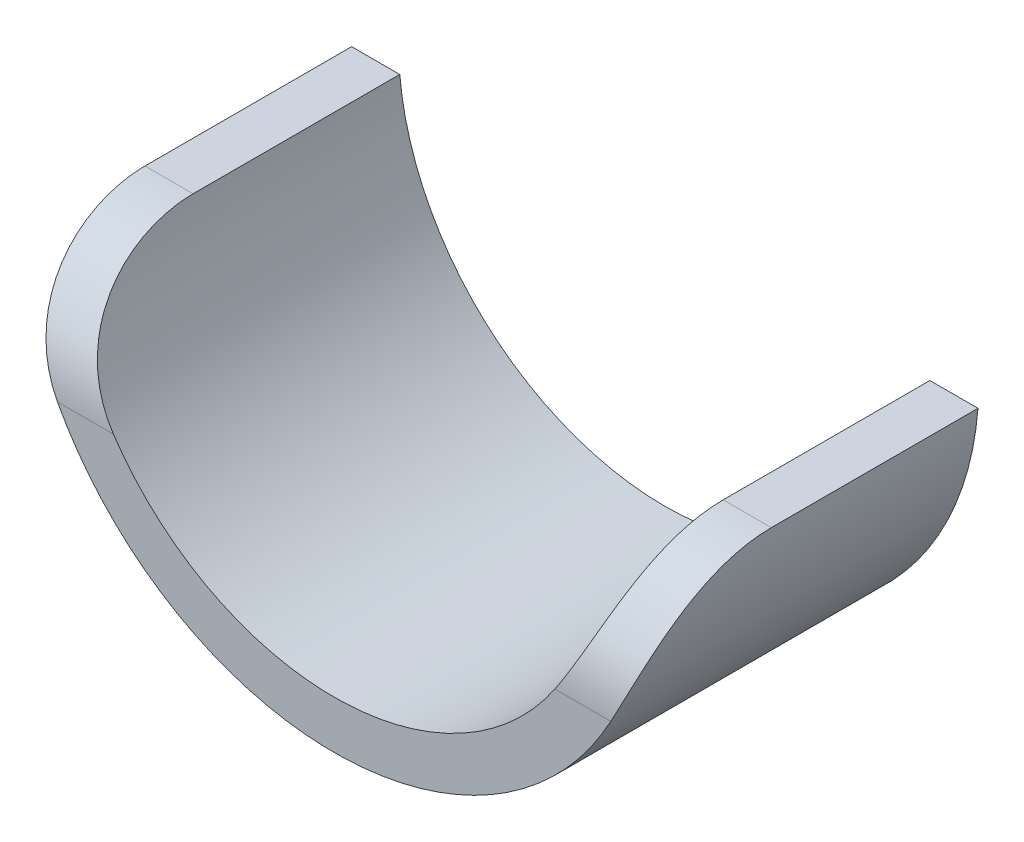
ISO-10303-21;
HEADER;
FILE_DESCRIPTION(('STEP AP214'),'2;1');
FILE_NAME('part.step','',(''),(''),'','','');
FILE_SCHEMA(('AUTOMOTIVE_DESIGN { 1 0 10303 214 1 1 1 1 }'));
ENDSEC;
DATA;
#1=APPLICATION_CONTEXT('core data for automotive mechanical design processes');
#2=APPLICATION_PROTOCOL_DEFINITION('international standard','automotive_design',2000,#1);
#3=PRODUCT_CONTEXT('',#1,'mechanical');
#4=PRODUCT('Part','Part','',(#3));
#5=PRODUCT_RELATED_PRODUCT_CATEGORY('part','',(#4));
#6=PRODUCT_DEFINITION_FORMATION('','',#4);
#7=PRODUCT_DEFINITION_CONTEXT('part definition',#1,'design');
#8=PRODUCT_DEFINITION('design','',#6,#7);
#9=PRODUCT_DEFINITION_SHAPE('','',#8);
#10=(LENGTH_UNIT() NAMED_UNIT(*) SI_UNIT(.MILLI.,.METRE.));
#11=(NAMED_UNIT(*) PLANE_ANGLE_UNIT() SI_UNIT($,.RADIAN.));
#12=(NAMED_UNIT(*) SI_UNIT($,.STERADIAN.) SOLID_ANGLE_UNIT());
#13=UNCERTAINTY_MEASURE_WITH_UNIT(LENGTH_MEASURE(1.E-05),#10,'distance_accuracy_value','');
#14=(GEOMETRIC_REPRESENTATION_CONTEXT(3) GLOBAL_UNCERTAINTY_ASSIGNED_CONTEXT((#13)) GLOBAL_UNIT_ASSIGNED_CONTEXT((#10,
#11,#12)) REPRESENTATION_CONTEXT('',''));
#15=CARTESIAN_POINT('',(0.,0.,0.));
#16=DIRECTION('',(0.,0.,1.));
#17=DIRECTION('',(1.,0.,0.));
#18=AXIS2_PLACEMENT_3D('',#15,#16,#17);
#19=CARTESIAN_POINT('',(0.,0.,0.));
#20=DIRECTION('',(0.,0.,1.));
#21=DIRECTION('',(1.,0.,0.));
#22=AXIS2_PLACEMENT_3D('',#19,#20,#21);
#23=CYLINDRICAL_SURFACE('',#22,20.447);
#24=CARTESIAN_POINT('',(20.3580643480661,-1.905,15.875));
#25=CARTESIAN_POINT('',(20.3580283743182,-1.90497110377044,16.1402102298547));
#26=CARTESIAN_POINT('',(20.3570267347558,-1.91607541741178,16.4054180979471));
#27=CARTESIAN_POINT('',(20.352832188804,-1.96034336128463,16.9339666940401));
#28=CARTESIAN_POINT('',(20.3496393032408,-1.99350678186011,17.1973074397624));
#29=CARTESIAN_POINT('',(20.3408028731761,-2.08168051639916,17.7202328918196));
#30=CARTESIAN_POINT('',(20.3351596248361,-2.13668819010333,17.9798180481544));
#31=CARTESIAN_POINT('',(20.3209194671558,-2.26813517562933,18.4934176434537));
#32=CARTESIAN_POINT('',(20.312322614697,-2.34457407471701,18.7474321895985));
#33=CARTESIAN_POINT('',(20.2915062917797,-2.51837915517059,19.2482709412747));
#34=CARTESIAN_POINT('',(20.2792839976529,-2.61576163208615,19.4950893769526));
#35=CARTESIAN_POINT('',(20.2504056126832,-2.83065885374987,19.9795302579563));
#36=CARTESIAN_POINT('',(20.2337496012912,-2.94817323772638,20.2171528679814));
#37=CARTESIAN_POINT('',(20.1950801117434,-3.20235227155138,20.6813968667695));
#38=CARTESIAN_POINT('',(20.1730679625452,-3.33901216747872,20.9080209677631));
#39=CARTESIAN_POINT('',(20.1226806227278,-3.63034088398203,21.3486359485486));
#40=CARTESIAN_POINT('',(20.0943055576867,-3.78500934911329,21.5626270775587));
#41=CARTESIAN_POINT('',(20.030560824482,-4.10893379759801,21.9737910836964));
#42=CARTESIAN_POINT('',(19.9952828225731,-4.27798374878302,22.1711404551238));
#43=CARTESIAN_POINT('',(19.9165452957226,-4.63073177356297,22.5505271872285));
#44=CARTESIAN_POINT('',(19.8730858362156,-4.81442972999755,22.7325646703523));
#45=CARTESIAN_POINT('',(19.7771267369428,-5.19456017598145,23.0799400708122));
#46=CARTESIAN_POINT('',(19.724633310632,-5.39098385541034,23.2452893429092));
#47=CARTESIAN_POINT('',(19.6098279166227,-5.7946943075757,23.5583716618498));
#48=CARTESIAN_POINT('',(19.5475162461149,-6.00198075137795,23.7061052416692));
#49=CARTESIAN_POINT('',(19.4144755131979,-6.41906899364777,23.9791033271186));
#50=CARTESIAN_POINT('',(19.3440467118341,-6.62861897179975,24.1048995061703));
#51=CARTESIAN_POINT('',(19.1930529525103,-7.05389488573657,24.3386995097784));
#52=CARTESIAN_POINT('',(19.112488048742,-7.26962078849771,24.4467034294521));
#53=CARTESIAN_POINT('',(18.9409635820805,-7.70549373801176,24.6448963006855));
#54=CARTESIAN_POINT('',(18.8499893436497,-7.92564665685007,24.7350595989152));
#55=CARTESIAN_POINT('',(18.6578079286869,-8.36804475355945,24.8975042974088));
#56=CARTESIAN_POINT('',(18.5566012015262,-8.59028983916224,24.9697864824619));
#57=CARTESIAN_POINT('',(18.3442481822495,-9.03487826701948,25.09684626075));
#58=CARTESIAN_POINT('',(18.2331065776499,-9.25722151419627,25.151632053993));
#59=CARTESIAN_POINT('',(18.0012194838146,-9.70043791104377,25.2443926711542));
#60=CARTESIAN_POINT('',(17.8804721898793,-9.92131077597433,25.2823643272213));
#61=CARTESIAN_POINT('',(17.6302342348166,-10.3594428106772,25.3422214514659));
#62=CARTESIAN_POINT('',(17.5007676745595,-10.5767100272521,25.3641494218749));
#63=CARTESIAN_POINT('',(17.2334730625404,-11.0068892110169,25.3930413515876));
#64=CARTESIAN_POINT('',(17.0956499678061,-11.219803661908,25.4000140946186));
#65=CARTESIAN_POINT('',(16.9539054202856,-11.4300000000005,25.4));
#66=B_SPLINE_CURVE_WITH_KNOTS('',3,(#24,#25,#26,#27,#28,#29,#30,#31,#32,#33,#34,#35,#36,#37,#38,
#39,#40,#41,#42,#43,#44,#45,#46,#47,#48,#49,#50,#51,#52,#53,#54,#55,#56,#57,#58,#59,#60,#61,#62,
#63,#64,#65),.UNSPECIFIED.,.F.,.F.,(4,2,2,2,2,2,2,2,2,2,2,2,2,2,2,2,2,2,2,2,4),(0.,
0.795393423654689,1.59077928777244,2.38606904486716,3.18134348689319,3.97723896055609,
4.77312017295292,5.5688041133931,6.3644723516572,7.15021538340831,7.93595213111671,
8.72115060258975,9.50632531127379,10.2684854549721,11.0306415240326,11.7938856708571,
12.5570963134924,13.3199487366032,14.0829448230853,14.8439122217058,15.6044325550745),.UNSPECIFIED.);
#67=CARTESIAN_POINT('',(20.3580643480667,-1.905,15.875));
#68=VERTEX_POINT('',#67);
#69=CARTESIAN_POINT('',(16.9539054202858,-11.4300000000002,25.4));
#70=VERTEX_POINT('',#69);
#71=EDGE_CURVE('E119',#68,#70,#66,.T.);
#72=ORIENTED_EDGE('',*,*,#71,.F.);
#73=DIRECTION('',(0.,0.,-1.));
#74=VECTOR('',#73,1.);
#75=CARTESIAN_POINT('',(20.3580643480672,-1.905,25.4));
#76=LINE('',#75,#74);
#77=CARTESIAN_POINT('',(20.3580643480667,-1.905,0.));
#78=VERTEX_POINT('',#77);
#79=EDGE_CURVE('E66',#68,#78,#76,.T.);
#80=ORIENTED_EDGE('',*,*,#79,.T.);
#81=CARTESIAN_POINT('',(0.,0.,0.));
#82=DIRECTION('',(0.,0.,1.));
#83=DIRECTION('',(1.,0.,0.));
#84=AXIS2_PLACEMENT_3D('',#81,#82,#83);
#85=CIRCLE('',#84,20.447);
#86=CARTESIAN_POINT('',(-20.3580643480667,-1.905,0.));
#87=VERTEX_POINT('',#86);
#88=EDGE_CURVE('E20',#78,#87,#85,.F.);
#89=ORIENTED_EDGE('',*,*,#88,.T.);
#90=DIRECTION('',(0.,0.,-1.));
#91=VECTOR('',#90,1.);
#92=CARTESIAN_POINT('',(-20.3580643480672,-1.905,25.4));
#93=LINE('',#92,#91);
#94=CARTESIAN_POINT('',(-20.3580643480667,-1.905,15.875));
#95=VERTEX_POINT('',#94);
#96=EDGE_CURVE('E71',#87,#95,#93,.F.);
#97=ORIENTED_EDGE('',*,*,#96,.T.);
#98=CARTESIAN_POINT('',(-16.9539054202856,-11.4300000000005,25.4));
#99=CARTESIAN_POINT('',(-17.1110348965794,-11.1970109347337,25.4000226556267));
#100=CARTESIAN_POINT('',(-17.2633409521732,-10.9606584924527,25.3914500347272));
#101=CARTESIAN_POINT('',(-17.5576316342127,-10.482734509668,25.355805674674));
#102=CARTESIAN_POINT('',(-17.6996080681934,-10.2411590195225,25.3287194254924));
#103=CARTESIAN_POINT('',(-17.9727321356882,-9.7539249200564,25.2546221946283));
#104=CARTESIAN_POINT('',(-18.1038453856934,-9.50825609668638,25.2075506354637));
#105=CARTESIAN_POINT('',(-18.3540664977229,-9.01577956315713,25.0924335496911));
#106=CARTESIAN_POINT('',(-18.4731775128224,-8.76897217002004,25.0243935508085));
#107=CARTESIAN_POINT('',(-18.6995490297243,-8.27531248509799,24.8661675409617));
#108=CARTESIAN_POINT('',(-18.8067447749872,-8.02846661678055,24.775868352864));
#109=CARTESIAN_POINT('',(-19.0083559040057,-7.53872313086937,24.572921907335));
#110=CARTESIAN_POINT('',(-19.1027701242965,-7.29582587447465,24.4602726177374));
#111=CARTESIAN_POINT('',(-19.2786895398163,-6.81738744881162,24.2129724372477));
#112=CARTESIAN_POINT('',(-19.360222754746,-6.58183123312732,24.0783706334243));
#113=CARTESIAN_POINT('',(-19.5110161349572,-6.12037421258561,23.7875131399525));
#114=CARTESIAN_POINT('',(-19.5802775147309,-5.89447245394794,23.6312595958167));
#115=CARTESIAN_POINT('',(-19.7015990829016,-5.47451213954666,23.3128068999594));
#116=CARTESIAN_POINT('',(-19.7546393047696,-5.27940511020501,23.1523591154929));
#117=CARTESIAN_POINT('',(-19.8518094278577,-4.90138340496403,22.8152389982501));
#118=CARTESIAN_POINT('',(-19.8959398183608,-4.71846805992874,22.6385675571706));
#119=CARTESIAN_POINT('',(-19.9761515798859,-4.36644050139858,22.2700553152654));
#120=CARTESIAN_POINT('',(-20.0122275652698,-4.19733757130713,22.0782044800326));
#121=CARTESIAN_POINT('',(-20.0772114901172,-3.87459604014159,21.6807751805306));
#122=CARTESIAN_POINT('',(-20.1061193740591,-3.72095755885489,21.4751966099471));
#123=CARTESIAN_POINT('',(-20.1574291495039,-3.43207667548712,21.0541231471337));
#124=CARTESIAN_POINT('',(-20.1798996243165,-3.2966491893578,20.8387634789851));
#125=CARTESIAN_POINT('',(-20.2196697315628,-3.0432271402361,20.39743775902));
#126=CARTESIAN_POINT('',(-20.2369670251252,-2.92524047465024,20.171466963014));
#127=CARTESIAN_POINT('',(-20.2672218373143,-2.70769131917894,19.7106066360459));
#128=CARTESIAN_POINT('',(-20.2801802255078,-2.60812513940783,19.4757189026592));
#129=CARTESIAN_POINT('',(-20.3025150068543,-2.42815162760397,18.9986688117078));
#130=CARTESIAN_POINT('',(-20.3118930616464,-2.34773541457413,18.756509885141));
#131=CARTESIAN_POINT('',(-20.3267077281063,-2.21553591633542,18.2975700959992));
#132=CARTESIAN_POINT('',(-20.3324935680789,-2.16141368417326,18.0814702333096));
#133=CARTESIAN_POINT('',(-20.3421616557291,-2.06843955546326,17.6459826812805));
#134=CARTESIAN_POINT('',(-20.3460440736285,-2.02958629348421,17.4265952877516));
#135=CARTESIAN_POINT('',(-20.352157279265,-1.96736786921803,16.9857348518923));
#136=CARTESIAN_POINT('',(-20.3543889527872,-1.94399440122066,16.7642629927905));
#137=CARTESIAN_POINT('',(-20.3573335916408,-1.91280264393239,16.3201947515685));
#138=CARTESIAN_POINT('',(-20.358046407436,-1.9049858862538,16.097598260887));
#139=CARTESIAN_POINT('',(-20.3580643480661,-1.905,15.875));
#140=B_SPLINE_CURVE_WITH_KNOTS('',3,(#98,#99,#100,#101,#102,#103,#104,#105,#106,#107,#108,#109,
#110,#111,#112,#113,#114,#115,#116,#117,#118,#119,#120,#121,#122,#123,#124,#125,#126,#127,#128,
#129,#130,#131,#132,#133,#134,#135,#136,#137,#138,#139),.UNSPECIFIED.,.F.,.F.,(4,2,2,2,2,2,2,2,
2,2,2,2,2,2,2,2,2,2,2,2,4),(0.,0.843012231859937,1.68668593203059,2.53293535688573,
3.37896188300101,4.22938213047327,5.07987973723872,5.92850102018473,6.77703827167084,
7.55044553476643,8.32381031468319,9.09769067222064,9.87157702376176,10.6368826673751,
11.4025337956785,12.1680313867014,12.9331732758273,13.6011795842376,14.2691261424277,
14.9367140217585,15.6043676241909),.UNSPECIFIED.);
#141=CARTESIAN_POINT('',(-16.9539054202858,-11.4300000000002,25.4));
#142=VERTEX_POINT('',#141);
#143=EDGE_CURVE('E111',#142,#95,#140,.T.);
#144=ORIENTED_EDGE('',*,*,#143,.F.);
#145=CARTESIAN_POINT('',(0.,0.,25.4));
#146=DIRECTION('',(0.,0.,1.));
#147=DIRECTION('',(1.,0.,0.));
#148=AXIS2_PLACEMENT_3D('',#145,#146,#147);
#149=CIRCLE('',#148,20.447);
#150=EDGE_CURVE('E117',#70,#142,#149,.F.);
#151=ORIENTED_EDGE('',*,*,#150,.F.);
#152=EDGE_LOOP('',(#72,#80,#89,#97,#144,#151));
#153=FACE_BOUND('',#152,.T.);
#154=ADVANCED_FACE('F16',(#153),#23,.F.);
#155=CARTESIAN_POINT('',(-24.13,-1.905,25.4));
#156=DIRECTION('',(0.,-1.,0.));
#157=DIRECTION('',(0.,0.,-1.));
#158=AXIS2_PLACEMENT_3D('',#155,#156,#157);
#159=PLANE('',#158);
#160=DIRECTION('',(1.,0.,0.));
#161=VECTOR('',#160,1.);
#162=CARTESIAN_POINT('',(0.,-1.905,0.));
#163=LINE('',#162,#161);
#164=CARTESIAN_POINT('',(-24.0546850945923,-1.90499999999999,0.));
#165=VERTEX_POINT('',#164);
#166=EDGE_CURVE('E75',#87,#165,#163,.F.);
#167=ORIENTED_EDGE('',*,*,#166,.T.);
#168=DIRECTION('',(0.,0.,1.));
#169=VECTOR('',#168,1.);
#170=CARTESIAN_POINT('',(-24.0546850945923,-1.90499999999997,0.));
#171=LINE('',#170,#169);
#172=CARTESIAN_POINT('',(-24.0546850945923,-1.90499999999999,15.875));
#173=VERTEX_POINT('',#172);
#174=EDGE_CURVE('E144',#173,#165,#171,.F.);
#175=ORIENTED_EDGE('',*,*,#174,.F.);
#176=DIRECTION('',(-1.,0.,0.));
#177=VECTOR('',#176,1.);
#178=CARTESIAN_POINT('',(86.7700600732234,-1.905,15.875));
#179=LINE('',#178,#177);
#180=EDGE_CURVE('E78',#95,#173,#179,.T.);
#181=ORIENTED_EDGE('',*,*,#180,.F.);
#182=ORIENTED_EDGE('',*,*,#96,.F.);
#183=EDGE_LOOP('',(#167,#175,#181,#182));
#184=FACE_BOUND('',#183,.T.);
#185=ADVANCED_FACE('F72',(#184),#159,.F.);
#186=CARTESIAN_POINT('',(0.,0.,0.));
#187=DIRECTION('',(0.,0.,1.));
#188=DIRECTION('',(1.,0.,0.));
#189=AXIS2_PLACEMENT_3D('',#186,#187,#188);
#190=PLANE('',#189);
#191=DIRECTION('',(1.,0.,0.));
#192=VECTOR('',#191,1.);
#193=CARTESIAN_POINT('',(-24.13,-1.905,0.));
#194=LINE('',#193,#192);
#195=CARTESIAN_POINT('',(24.0546850945923,-1.905,0.));
#196=VERTEX_POINT('',#195);
#197=EDGE_CURVE('E90',#78,#196,#194,.T.);
#198=ORIENTED_EDGE('',*,*,#197,.T.);
#199=CARTESIAN_POINT('',(0.,0.,0.));
#200=DIRECTION('',(0.,0.,1.));
#201=DIRECTION('',(1.,0.,0.));
#202=AXIS2_PLACEMENT_3D('',#199,#200,#201);
#203=CIRCLE('',#202,24.13);
#204=EDGE_CURVE('E86',#165,#196,#203,.T.);
#205=ORIENTED_EDGE('',*,*,#204,.F.);
#206=ORIENTED_EDGE('',*,*,#166,.F.);
#207=ORIENTED_EDGE('',*,*,#88,.F.);
#208=EDGE_LOOP('',(#198,#205,#206,#207));
#209=FACE_BOUND('',#208,.T.);
#210=ADVANCED_FACE('F84',(#209),#190,.F.);
#211=CARTESIAN_POINT('',(-24.13,-1.905,25.4));
#212=DIRECTION('',(0.,-1.,0.));
#213=DIRECTION('',(0.,0.,-1.));
#214=AXIS2_PLACEMENT_3D('',#211,#212,#213);
#215=PLANE('',#214);
#216=ORIENTED_EDGE('',*,*,#197,.F.);
#217=ORIENTED_EDGE('',*,*,#79,.F.);
#218=DIRECTION('',(-1.,0.,0.));
#219=VECTOR('',#218,1.);
#220=CARTESIAN_POINT('',(86.7700600732234,-1.905,15.875));
#221=LINE('',#220,#219);
#222=CARTESIAN_POINT('',(24.0546850945923,-1.905,15.875));
#223=VERTEX_POINT('',#222);
#224=EDGE_CURVE('E123',#223,#68,#221,.T.);
#225=ORIENTED_EDGE('',*,*,#224,.F.);
#226=DIRECTION('',(0.,0.,1.));
#227=VECTOR('',#226,1.);
#228=CARTESIAN_POINT('',(24.0546850945923,-1.90499999999999,0.));
#229=LINE('',#228,#227);
#230=EDGE_CURVE('E137',#196,#223,#229,.T.);
#231=ORIENTED_EDGE('',*,*,#230,.F.);
#232=EDGE_LOOP('',(#216,#217,#225,#231));
#233=FACE_BOUND('',#232,.T.);
#234=ADVANCED_FACE('F128',(#233),#215,.F.);
#235=CARTESIAN_POINT('',(86.7700600732234,-11.43,15.875));
#236=DIRECTION('',(-1.,0.,0.));
#237=DIRECTION('',(0.,0.,1.));
#238=AXIS2_PLACEMENT_3D('',#235,#236,#237);
#239=CYLINDRICAL_SURFACE('',#238,9.525);
#240=ORIENTED_EDGE('',*,*,#224,.T.);
#241=ORIENTED_EDGE('',*,*,#71,.T.);
#242=DIRECTION('',(1.,0.,0.));
#243=VECTOR('',#242,1.);
#244=CARTESIAN_POINT('',(0.,-11.43,25.4));
#245=LINE('',#244,#243);
#246=CARTESIAN_POINT('',(21.2511646739655,-11.43,25.4));
#247=VERTEX_POINT('',#246);
#248=EDGE_CURVE('E118',#247,#70,#245,.F.);
#249=ORIENTED_EDGE('',*,*,#248,.F.);
#250=CARTESIAN_POINT('',(24.0546850945923,-1.905,15.875));
#251=CARTESIAN_POINT('',(24.0546543706783,-1.90497112249099,16.1409714413934));
#252=CARTESIAN_POINT('',(24.0538018907344,-1.91613908815105,16.4069400320739));
#253=CARTESIAN_POINT('',(24.0502314004206,-1.96066129940309,16.9369961272644));
#254=CARTESIAN_POINT('',(24.0475134277582,-1.99401509654734,17.2010836696873));
#255=CARTESIAN_POINT('',(24.0399910936523,-2.08268810274374,17.7254334921366));
#256=CARTESIAN_POINT('',(24.0351873665735,-2.1380006327919,17.9856969103763));
#257=CARTESIAN_POINT('',(24.0230644040504,-2.2701777631287,18.5006286159835));
#258=CARTESIAN_POINT('',(24.0157452121526,-2.34704199031998,18.7552970001285));
#259=CARTESIAN_POINT('',(23.9980216823762,-2.52181707329971,19.2573979344783));
#260=CARTESIAN_POINT('',(23.9876151932781,-2.61974259140439,19.5048253066537));
#261=CARTESIAN_POINT('',(23.9630257307452,-2.83586324053375,19.9904676925044));
#262=CARTESIAN_POINT('',(23.9488428057835,-2.9540581113811,20.22868282438));
#263=CARTESIAN_POINT('',(23.9159133288637,-3.20976539159896,20.6941133896688));
#264=CARTESIAN_POINT('',(23.8971677906916,-3.34727350681212,20.9213312531841));
#265=CARTESIAN_POINT('',(23.8542560267361,-3.64051036300694,21.3631480940328));
#266=CARTESIAN_POINT('',(23.8300898850306,-3.79623882135804,21.5777472670274));
#267=CARTESIAN_POINT('',(23.7757019327644,-4.12311644738061,21.9908668963949));
#268=CARTESIAN_POINT('',(23.7455368268045,-4.29411352349554,22.1895151415346));
#269=CARTESIAN_POINT('',(23.6781748356056,-4.65123007876343,22.5714355282988));
#270=CARTESIAN_POINT('',(23.6409779826139,-4.83734948856389,22.7547077404316));
#271=CARTESIAN_POINT('',(23.5587888909164,-5.22294907941938,23.1045141824383));
#272=CARTESIAN_POINT('',(23.5138002140805,-5.42242313023071,23.2710560055365));
#273=CARTESIAN_POINT('',(23.4153383321293,-5.83295582002549,23.5864014341545));
#274=CARTESIAN_POINT('',(23.3618653413296,-6.04401416629933,23.7352054875674));
#275=CARTESIAN_POINT('',(23.2471317644862,-6.47113711214399,24.011251447842));
#276=CARTESIAN_POINT('',(23.1860605993367,-6.68700031712436,24.1388840349217));
#277=CARTESIAN_POINT('',(23.0549352631465,-7.12596104699,24.375769016095));
#278=CARTESIAN_POINT('',(22.9848810136632,-7.34905863503499,24.4850212496675));
#279=CARTESIAN_POINT('',(22.8355565811858,-7.80069709441672,24.6849280427475));
#280=CARTESIAN_POINT('',(22.7562780033086,-8.02924277118396,24.7755654505681));
#281=CARTESIAN_POINT('',(22.5885730040502,-8.48959759740636,24.9380698866867));
#282=CARTESIAN_POINT('',(22.5001473529379,-8.72140647065202,25.0099384936993));
#283=CARTESIAN_POINT('',(22.3243212812767,-9.16141574281792,25.1283965862276));
#284=CARTESIAN_POINT('',(22.2378315842086,-9.36947657204712,25.176872535527));
#285=CARTESIAN_POINT('',(22.0579381550128,-9.7854805725288,25.2593565501162));
#286=CARTESIAN_POINT('',(21.9645342350342,-9.9934237404298,25.2933642221513));
#287=CARTESIAN_POINT('',(21.7713545092491,-10.4075477143403,25.347259877931));
#288=CARTESIAN_POINT('',(21.6715943779709,-10.6137315346704,25.3671812336891));
#289=CARTESIAN_POINT('',(21.4659113001519,-11.023810001918,25.393555082785));
#290=CARTESIAN_POINT('',(21.3599900405858,-11.2277052573947,25.4000112453408));
#291=CARTESIAN_POINT('',(21.2511646739657,-11.4299999999997,25.4));
#292=B_SPLINE_CURVE_WITH_KNOTS('',3,(#250,#251,#252,#253,#254,#255,#256,#257,#258,#259,#260,
#261,#262,#263,#264,#265,#266,#267,#268,#269,#270,#271,#272,#273,#274,#275,#276,#277,#278,#279,
#280,#281,#282,#283,#284,#285,#286,#287,#288,#289,#290,#291),.UNSPECIFIED.,.F.,.F.,(4,2,2,2,2,2,
2,2,2,2,2,2,2,2,2,2,2,2,2,2,4),(0.,0.79767480720018,1.59533349129077,2.39274974387176,
3.19015219264293,3.98811157936094,4.78606072424157,5.58383273105667,6.38159236462162,
7.17214191497642,7.96268783999794,8.75287333268876,9.54303886831845,10.316430031771,
11.0898279491281,11.8639353089751,12.6379775347455,13.3288503903547,14.0197420230187,
14.7089913240002,15.3980527824101),.UNSPECIFIED.);
#293=EDGE_CURVE('E132',#223,#247,#292,.T.);
#294=ORIENTED_EDGE('',*,*,#293,.F.);
#295=EDGE_LOOP('',(#240,#241,#249,#294));
#296=FACE_BOUND('',#295,.T.);
#297=ADVANCED_FACE('F124',(#296),#239,.T.);
#298=CARTESIAN_POINT('',(0.,0.,25.4));
#299=DIRECTION('',(0.,0.,1.));
#300=DIRECTION('',(1.,0.,0.));
#301=AXIS2_PLACEMENT_3D('',#298,#299,#300);
#302=PLANE('',#301);
#303=ORIENTED_EDGE('',*,*,#150,.T.);
#304=DIRECTION('',(-1.,0.,0.));
#305=VECTOR('',#304,1.);
#306=CARTESIAN_POINT('',(86.7700600732234,-11.43,25.4));
#307=LINE('',#306,#305);
#308=CARTESIAN_POINT('',(-21.2511646739656,-11.4299999999999,25.4));
#309=VERTEX_POINT('',#308);
#310=EDGE_CURVE('E35',#309,#142,#307,.F.);
#311=ORIENTED_EDGE('',*,*,#310,.F.);
#312=CARTESIAN_POINT('',(0.,0.,25.4));
#313=DIRECTION('',(0.,0.,1.));
#314=DIRECTION('',(1.,0.,0.));
#315=AXIS2_PLACEMENT_3D('',#312,#313,#314);
#316=CIRCLE('',#315,24.13);
#317=EDGE_CURVE('E26',#247,#309,#316,.F.);
#318=ORIENTED_EDGE('',*,*,#317,.F.);
#319=ORIENTED_EDGE('',*,*,#248,.T.);
#320=EDGE_LOOP('',(#303,#311,#318,#319));
#321=FACE_BOUND('',#320,.T.);
#322=ADVANCED_FACE('F106',(#321),#302,.T.);
#323=CARTESIAN_POINT('',(86.7700600732234,-11.43,15.875));
#324=DIRECTION('',(-1.,0.,0.));
#325=DIRECTION('',(0.,0.,1.));
#326=AXIS2_PLACEMENT_3D('',#323,#324,#325);
#327=CYLINDRICAL_SURFACE('',#326,9.525);
#328=ORIENTED_EDGE('',*,*,#180,.T.);
#329=CARTESIAN_POINT('',(-21.2511646739657,-11.4299999999997,25.4));
#330=CARTESIAN_POINT('',(-21.382433539311,-11.186022464054,25.4000262243007));
#331=CARTESIAN_POINT('',(-21.5094658719946,-10.9396845502,25.390625226913));
#332=CARTESIAN_POINT('',(-21.7544876609396,-10.4439055163115,25.3520763604122));
#333=CARTESIAN_POINT('',(-21.8724717766097,-10.1944626630501,25.3229169274913));
#334=CARTESIAN_POINT('',(-22.0988883031837,-9.6939031188028,25.2438811628811));
#335=CARTESIAN_POINT('',(-22.2073020174488,-9.44278413916148,25.1939653220145));
#336=CARTESIAN_POINT('',(-22.4138311063667,-8.94150477192927,25.0727976311978));
#337=CARTESIAN_POINT('',(-22.5119485785535,-8.69134419913728,25.0015501383378));
#338=CARTESIAN_POINT('',(-22.697987397351,-8.19324315777392,24.837035897122));
#339=CARTESIAN_POINT('',(-22.7858670176028,-7.94531533145681,24.74368343928));
#340=CARTESIAN_POINT('',(-22.950920286426,-7.45513554205424,24.5350822568299));
#341=CARTESIAN_POINT('',(-23.0280931434997,-7.21288399968715,24.4198319149111));
#342=CARTESIAN_POINT('',(-23.1717872843802,-6.73697795539704,24.1679808945322));
#343=CARTESIAN_POINT('',(-23.238325368346,-6.50331035205257,24.0314145781476));
#344=CARTESIAN_POINT('',(-23.3613112980713,-6.04664831564493,23.7374976111355));
#345=CARTESIAN_POINT('',(-23.417759861925,-5.82365312382973,23.5801484410583));
#346=CARTESIAN_POINT('',(-23.5178520749754,-5.40470991060279,23.2565289044685));
#347=CARTESIAN_POINT('',(-23.5620882559331,-5.20794553211151,23.09149629587));
#348=CARTESIAN_POINT('',(-23.6429526368408,-4.82757709066192,22.7452094936832));
#349=CARTESIAN_POINT('',(-23.6795811205675,-4.64397253699301,22.5639559055187));
#350=CARTESIAN_POINT('',(-23.7460034791518,-4.29143598197436,22.1863614795688));
#351=CARTESIAN_POINT('',(-23.7757936768714,-4.12251190492299,21.9900126000184));
#352=CARTESIAN_POINT('',(-23.8293278664702,-3.8008713904997,21.5836916173809));
#353=CARTESIAN_POINT('',(-23.8530718455232,-3.64815498751063,21.373719485395));
#354=CARTESIAN_POINT('',(-23.895213047223,-3.36104542848584,20.9429571443455));
#355=CARTESIAN_POINT('',(-23.9136419215247,-3.22654644377802,20.7222405269028));
#356=CARTESIAN_POINT('',(-23.9461355713094,-2.97581587645172,20.2703568855941));
#357=CARTESIAN_POINT('',(-23.9602003046431,-2.85958447026906,20.0391897608205));
#358=CARTESIAN_POINT('',(-23.9846954693647,-2.64628232956122,19.5680719041688));
#359=CARTESIAN_POINT('',(-23.9951268417838,-2.54920663658389,19.3281234644464));
#360=CARTESIAN_POINT('',(-24.0130070257699,-2.37488541721309,18.8410436270895));
#361=CARTESIAN_POINT('',(-24.0204562216298,-2.29763733622996,18.5939131593595));
#362=CARTESIAN_POINT('',(-24.0316919659944,-2.17660389124132,18.1429614045295));
#363=CARTESIAN_POINT('',(-24.0359096588211,-2.12922984902609,17.9401048839392));
#364=CARTESIAN_POINT('',(-24.0429774229925,-2.04787644322709,17.5317203009418));
#365=CARTESIAN_POINT('',(-24.0458276798666,-2.01389526265418,17.32619260484));
#366=CARTESIAN_POINT('',(-24.0503232209338,-1.95949981658251,16.913517140901));
#367=CARTESIAN_POINT('',(-24.0519695285443,-1.93907402968681,16.70637090067));
#368=CARTESIAN_POINT('',(-24.0541447550348,-1.9118178800914,16.2911504940653));
#369=CARTESIAN_POINT('',(-24.0546735144979,-1.90498945704754,16.0830761995474));
#370=CARTESIAN_POINT('',(-24.0546850945923,-1.905,15.875));
#371=B_SPLINE_CURVE_WITH_KNOTS('',3,(#329,#330,#331,#332,#333,#334,#335,#336,#337,#338,#339,
#340,#341,#342,#343,#344,#345,#346,#347,#348,#349,#350,#351,#352,#353,#354,#355,#356,#357,#358,
#359,#360,#361,#362,#363,#364,#365,#366,#367,#368,#369,#370),.UNSPECIFIED.,.F.,.F.,(4,2,2,2,2,2,
2,2,2,2,2,2,2,2,2,2,2,2,2,2,4),(0.,0.831053790770298,1.66259438406462,2.49572508742814,
3.32868573588823,4.16493056434454,5.00123717930455,5.83620930417517,6.67112197849122,
7.45196225401332,8.23277339798141,9.0140034275285,9.79523511433863,10.5717136526311,
11.3481996900132,12.1244844697336,12.9006691826561,13.5253091224102,14.1498642890196,
14.7738879332269,15.3980005876604),.UNSPECIFIED.);
#372=EDGE_CURVE('E11',#309,#173,#371,.T.);
#373=ORIENTED_EDGE('',*,*,#372,.F.);
#374=ORIENTED_EDGE('',*,*,#310,.T.);
#375=ORIENTED_EDGE('',*,*,#143,.T.);
#376=EDGE_LOOP('',(#328,#373,#374,#375));
#377=FACE_BOUND('',#376,.T.);
#378=ADVANCED_FACE('F102',(#377),#327,.T.);
#379=CARTESIAN_POINT('',(0.,0.,0.));
#380=DIRECTION('',(0.,0.,1.));
#381=DIRECTION('',(1.,0.,0.));
#382=AXIS2_PLACEMENT_3D('',#379,#380,#381);
#383=CYLINDRICAL_SURFACE('',#382,24.13);
#384=ORIENTED_EDGE('',*,*,#317,.T.);
#385=ORIENTED_EDGE('',*,*,#372,.T.);
#386=ORIENTED_EDGE('',*,*,#174,.T.);
#387=ORIENTED_EDGE('',*,*,#204,.T.);
#388=ORIENTED_EDGE('',*,*,#230,.T.);
#389=ORIENTED_EDGE('',*,*,#293,.T.);
#390=EDGE_LOOP('',(#384,#385,#386,#387,#388,#389));
#391=FACE_BOUND('',#390,.T.);
#392=ADVANCED_FACE('F100',(#391),#383,.T.);
#393=CLOSED_SHELL('',(#154,#185,#210,#234,#297,#322,#378,#392));
#394=MANIFOLD_SOLID_BREP('B1',#393);
#395=ADVANCED_BREP_SHAPE_REPRESENTATION('',(#18,#394),#14);
#396=SHAPE_DEFINITION_REPRESENTATION(#9,#395);
ENDSEC;
END-ISO-10303-21;
